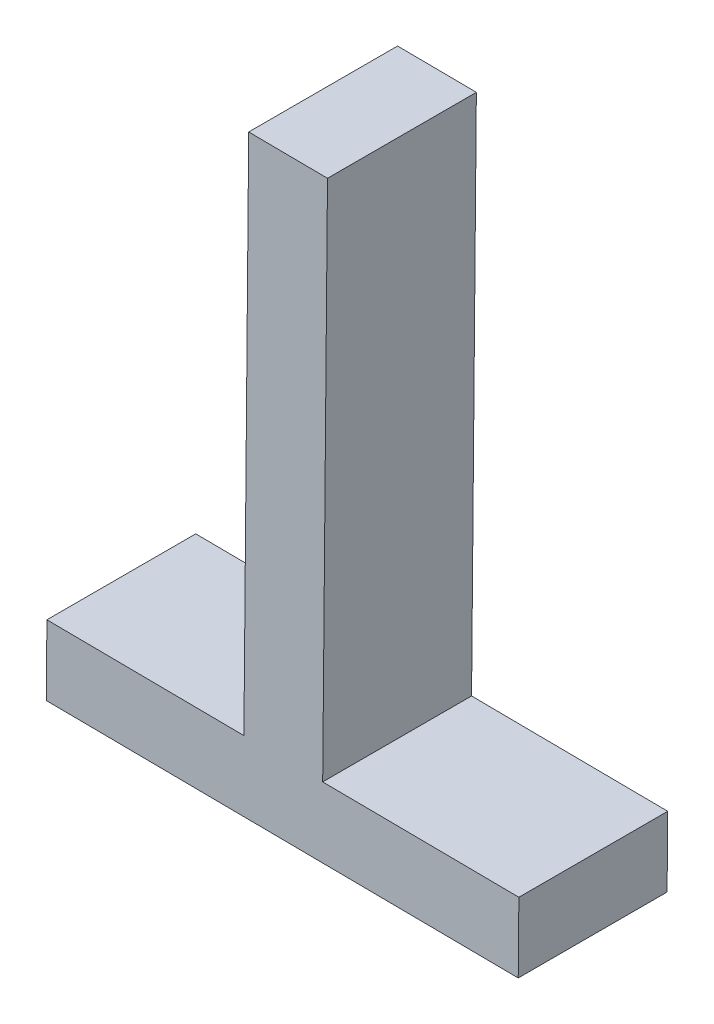
ISO-10303-21;
HEADER;
FILE_DESCRIPTION(('STEP AP214'),'2;1');
FILE_NAME('part.step','',(''),(''),'','','');
FILE_SCHEMA(('AUTOMOTIVE_DESIGN { 1 0 10303 214 1 1 1 1 }'));
ENDSEC;
DATA;
#1=APPLICATION_CONTEXT('core data for automotive mechanical design processes');
#2=APPLICATION_PROTOCOL_DEFINITION('international standard','automotive_design',2000,#1);
#3=PRODUCT_CONTEXT('',#1,'mechanical');
#4=PRODUCT('Part','Part','',(#3));
#5=PRODUCT_RELATED_PRODUCT_CATEGORY('part','',(#4));
#6=PRODUCT_DEFINITION_FORMATION('','',#4);
#7=PRODUCT_DEFINITION_CONTEXT('part definition',#1,'design');
#8=PRODUCT_DEFINITION('design','',#6,#7);
#9=PRODUCT_DEFINITION_SHAPE('','',#8);
#10=(LENGTH_UNIT() NAMED_UNIT(*) SI_UNIT(.MILLI.,.METRE.));
#11=(NAMED_UNIT(*) PLANE_ANGLE_UNIT() SI_UNIT($,.RADIAN.));
#12=(NAMED_UNIT(*) SI_UNIT($,.STERADIAN.) SOLID_ANGLE_UNIT());
#13=UNCERTAINTY_MEASURE_WITH_UNIT(LENGTH_MEASURE(1.E-05),#10,'distance_accuracy_value','');
#14=(GEOMETRIC_REPRESENTATION_CONTEXT(3) GLOBAL_UNCERTAINTY_ASSIGNED_CONTEXT((#13)) GLOBAL_UNIT_ASSIGNED_CONTEXT((#10,
#11,#12)) REPRESENTATION_CONTEXT('',''));
#15=CARTESIAN_POINT('',(0.,0.,0.));
#16=DIRECTION('',(0.,0.,1.));
#17=DIRECTION('',(1.,0.,0.));
#18=AXIS2_PLACEMENT_3D('',#15,#16,#17);
#19=CARTESIAN_POINT('',(2.9457992754223,7.53395539637065,0.));
#20=DIRECTION('',(0.00913854515184405,0.999958242624415,0.));
#21=DIRECTION('',(0.,0.,-1.));
#22=AXIS2_PLACEMENT_3D('',#19,#20,#21);
#23=PLANE('',#22);
#24=DIRECTION('',(0.999958242624415,-0.00913854515184405,0.));
#25=VECTOR('',#24,1.);
#26=CARTESIAN_POINT('',(2.61498093654606,7.53697872094363,0.));
#27=LINE('',#26,#25);
#28=CARTESIAN_POINT('',(2.61498093654606,7.53697872094363,0.));
#29=VERTEX_POINT('',#28);
#30=CARTESIAN_POINT('',(2.9457992754223,7.53395539637065,0.));
#31=VERTEX_POINT('',#30);
#32=EDGE_CURVE('E111',#29,#31,#27,.T.);
#33=ORIENTED_EDGE('',*,*,#32,.F.);
#34=DIRECTION('',(0.,0.,1.));
#35=VECTOR('',#34,1.);
#36=CARTESIAN_POINT('',(2.61498093654606,7.53697872094363,0.));
#37=LINE('',#36,#35);
#38=CARTESIAN_POINT('',(2.61498093654606,7.53697872094363,0.25));
#39=VERTEX_POINT('',#38);
#40=EDGE_CURVE('E90',#29,#39,#37,.T.);
#41=ORIENTED_EDGE('',*,*,#40,.T.);
#42=DIRECTION('',(-0.999958242624415,0.00913854515184405,0.));
#43=VECTOR('',#42,1.);
#44=CARTESIAN_POINT('',(2.61498093654606,7.53697872094363,0.25));
#45=LINE('',#44,#43);
#46=CARTESIAN_POINT('',(2.9457992754223,7.53395539637065,0.25));
#47=VERTEX_POINT('',#46);
#48=EDGE_CURVE('E148',#47,#39,#45,.T.);
#49=ORIENTED_EDGE('',*,*,#48,.F.);
#50=DIRECTION('',(0.,0.,1.));
#51=VECTOR('',#50,1.);
#52=CARTESIAN_POINT('',(2.9457992754223,7.53395539637065,0.));
#53=LINE('',#52,#51);
#54=EDGE_CURVE('E11',#31,#47,#53,.T.);
#55=ORIENTED_EDGE('',*,*,#54,.F.);
#56=EDGE_LOOP('',(#33,#41,#49,#55));
#57=FACE_BOUND('',#56,.T.);
#58=ADVANCED_FACE('F16',(#57),#23,.T.);
#59=CARTESIAN_POINT('',(2.95385939761582,8.41591040015481,0.));
#60=DIRECTION('',(-0.999958242624415,0.00913854515184294,0.));
#61=DIRECTION('',(0.,0.,1.));
#62=AXIS2_PLACEMENT_3D('',#59,#60,#61);
#63=PLANE('',#62);
#64=DIRECTION('',(0.00913854515184294,0.999958242624415,0.));
#65=VECTOR('',#64,1.);
#66=CARTESIAN_POINT('',(2.9457992754223,7.53395539637065,0.));
#67=LINE('',#66,#65);
#68=CARTESIAN_POINT('',(2.95385939761582,8.41591040015481,0.));
#69=VERTEX_POINT('',#68);
#70=EDGE_CURVE('E131',#31,#69,#67,.T.);
#71=ORIENTED_EDGE('',*,*,#70,.F.);
#72=ORIENTED_EDGE('',*,*,#54,.T.);
#73=DIRECTION('',(-0.00913854515184294,-0.999958242624415,0.));
#74=VECTOR('',#73,1.);
#75=CARTESIAN_POINT('',(2.9457992754223,7.53395539637065,0.25));
#76=LINE('',#75,#74);
#77=CARTESIAN_POINT('',(2.95385939761582,8.41591040015481,0.25));
#78=VERTEX_POINT('',#77);
#79=EDGE_CURVE('E152',#78,#47,#76,.T.);
#80=ORIENTED_EDGE('',*,*,#79,.F.);
#81=DIRECTION('',(0.,0.,1.));
#82=VECTOR('',#81,1.);
#83=CARTESIAN_POINT('',(2.95385939761582,8.41591040015481,0.));
#84=LINE('',#83,#82);
#85=EDGE_CURVE('E27',#69,#78,#84,.T.);
#86=ORIENTED_EDGE('',*,*,#85,.F.);
#87=EDGE_LOOP('',(#71,#72,#80,#86));
#88=FACE_BOUND('',#87,.T.);
#89=ADVANCED_FACE('F211',(#88),#63,.T.);
#90=CARTESIAN_POINT('',(3.08618680021874,8.41470106971283,0.));
#91=DIRECTION('',(0.00913854515184033,0.999958242624415,0.));
#92=DIRECTION('',(0.,0.,-1.));
#93=AXIS2_PLACEMENT_3D('',#90,#91,#92);
#94=PLANE('',#93);
#95=DIRECTION('',(0.999958242624415,-0.00913854515184033,0.));
#96=VECTOR('',#95,1.);
#97=CARTESIAN_POINT('',(2.95385939761582,8.41591040015481,0.));
#98=LINE('',#97,#96);
#99=CARTESIAN_POINT('',(3.08618680021874,8.41470106971283,0.));
#100=VERTEX_POINT('',#99);
#101=EDGE_CURVE('E123',#69,#100,#98,.T.);
#102=ORIENTED_EDGE('',*,*,#101,.F.);
#103=ORIENTED_EDGE('',*,*,#85,.T.);
#104=DIRECTION('',(-0.999958242624415,0.00913854515184033,0.));
#105=VECTOR('',#104,1.);
#106=CARTESIAN_POINT('',(2.95385939761582,8.41591040015481,0.25));
#107=LINE('',#106,#105);
#108=CARTESIAN_POINT('',(3.08618680021874,8.41470106971283,0.25));
#109=VERTEX_POINT('',#108);
#110=EDGE_CURVE('E170',#109,#78,#107,.T.);
#111=ORIENTED_EDGE('',*,*,#110,.F.);
#112=DIRECTION('',(0.,0.,1.));
#113=VECTOR('',#112,1.);
#114=CARTESIAN_POINT('',(3.08618680021874,8.41470106971283,0.));
#115=LINE('',#114,#113);
#116=EDGE_CURVE('E167',#100,#109,#115,.T.);
#117=ORIENTED_EDGE('',*,*,#116,.F.);
#118=EDGE_LOOP('',(#102,#103,#111,#117));
#119=FACE_BOUND('',#118,.T.);
#120=ADVANCED_FACE('F213',(#119),#94,.T.);
#121=CARTESIAN_POINT('',(2.61498093654606,7.53697872094363,0.));
#122=DIRECTION('',(-0.999958242624415,0.00913854515184164,0.));
#123=DIRECTION('',(0.,0.,1.));
#124=AXIS2_PLACEMENT_3D('',#121,#122,#123);
#125=PLANE('',#124);
#126=DIRECTION('',(0.00913854515184164,0.999958242624415,0.));
#127=VECTOR('',#126,1.);
#128=CARTESIAN_POINT('',(2.61390251345156,7.41897546720283,0.));
#129=LINE('',#128,#127);
#130=CARTESIAN_POINT('',(2.61390251345156,7.41897546720283,0.));
#131=VERTEX_POINT('',#130);
#132=EDGE_CURVE('E106',#131,#29,#129,.T.);
#133=ORIENTED_EDGE('',*,*,#132,.F.);
#134=DIRECTION('',(0.,0.,1.));
#135=VECTOR('',#134,1.);
#136=CARTESIAN_POINT('',(2.61390251345156,7.41897546720283,0.));
#137=LINE('',#136,#135);
#138=CARTESIAN_POINT('',(2.61390251345156,7.41897546720283,0.25));
#139=VERTEX_POINT('',#138);
#140=EDGE_CURVE('E95',#131,#139,#137,.T.);
#141=ORIENTED_EDGE('',*,*,#140,.T.);
#142=DIRECTION('',(-0.00913854515184164,-0.999958242624415,0.));
#143=VECTOR('',#142,1.);
#144=CARTESIAN_POINT('',(2.61390251345156,7.41897546720283,0.25));
#145=LINE('',#144,#143);
#146=EDGE_CURVE('E20',#39,#139,#145,.T.);
#147=ORIENTED_EDGE('',*,*,#146,.F.);
#148=ORIENTED_EDGE('',*,*,#40,.F.);
#149=EDGE_LOOP('',(#133,#141,#147,#148));
#150=FACE_BOUND('',#149,.T.);
#151=ADVANCED_FACE('F107',(#150),#125,.T.);
#152=CARTESIAN_POINT('',(3.40650243083946,7.41173195460036,0.));
#153=DIRECTION('',(0.999958242624415,-0.00913854515184164,0.));
#154=DIRECTION('',(0.,0.,-1.));
#155=AXIS2_PLACEMENT_3D('',#152,#153,#154);
#156=PLANE('',#155);
#157=DIRECTION('',(-0.00913854515184164,-0.999958242624415,0.));
#158=VECTOR('',#157,1.);
#159=CARTESIAN_POINT('',(3.40758085393395,7.52973520834115,0.));
#160=LINE('',#159,#158);
#161=CARTESIAN_POINT('',(3.40758085393395,7.52973520834115,0.));
#162=VERTEX_POINT('',#161);
#163=CARTESIAN_POINT('',(3.40650243083946,7.41173195460036,0.));
#164=VERTEX_POINT('',#163);
#165=EDGE_CURVE('E115',#162,#164,#160,.T.);
#166=ORIENTED_EDGE('',*,*,#165,.F.);
#167=DIRECTION('',(0.,0.,1.));
#168=VECTOR('',#167,1.);
#169=CARTESIAN_POINT('',(3.40758085393395,7.52973520834115,0.));
#170=LINE('',#169,#168);
#171=CARTESIAN_POINT('',(3.40758085393395,7.52973520834115,0.25));
#172=VERTEX_POINT('',#171);
#173=EDGE_CURVE('E137',#162,#172,#170,.T.);
#174=ORIENTED_EDGE('',*,*,#173,.T.);
#175=DIRECTION('',(0.00913854515184164,0.999958242624415,0.));
#176=VECTOR('',#175,1.);
#177=CARTESIAN_POINT('',(3.40758085393395,7.52973520834115,0.25));
#178=LINE('',#177,#176);
#179=CARTESIAN_POINT('',(3.40650243083946,7.41173195460036,0.25));
#180=VERTEX_POINT('',#179);
#181=EDGE_CURVE('E155',#180,#172,#178,.T.);
#182=ORIENTED_EDGE('',*,*,#181,.F.);
#183=DIRECTION('',(0.,0.,1.));
#184=VECTOR('',#183,1.);
#185=CARTESIAN_POINT('',(3.40650243083946,7.41173195460036,0.));
#186=LINE('',#185,#184);
#187=EDGE_CURVE('E41',#164,#180,#186,.T.);
#188=ORIENTED_EDGE('',*,*,#187,.F.);
#189=EDGE_LOOP('',(#166,#174,#182,#188));
#190=FACE_BOUND('',#189,.T.);
#191=ADVANCED_FACE('F218',(#190),#156,.T.);
#192=CARTESIAN_POINT('',(2.61390251345156,7.41897546720283,0.));
#193=DIRECTION('',(-0.00913854515184324,-0.999958242624415,0.));
#194=DIRECTION('',(-0.999958242624415,0.00913854515184324,0.));
#195=AXIS2_PLACEMENT_3D('',#192,#193,#194);
#196=PLANE('',#195);
#197=DIRECTION('',(-0.999958242624415,0.00913854515184324,0.));
#198=VECTOR('',#197,1.);
#199=CARTESIAN_POINT('',(3.40650243083946,7.41173195460036,0.));
#200=LINE('',#199,#198);
#201=EDGE_CURVE('E98',#164,#131,#200,.T.);
#202=ORIENTED_EDGE('',*,*,#201,.F.);
#203=ORIENTED_EDGE('',*,*,#187,.T.);
#204=DIRECTION('',(0.999958242624415,-0.00913854515184324,0.));
#205=VECTOR('',#204,1.);
#206=CARTESIAN_POINT('',(3.40650243083946,7.41173195460036,0.25));
#207=LINE('',#206,#205);
#208=EDGE_CURVE('E101',#139,#180,#207,.T.);
#209=ORIENTED_EDGE('',*,*,#208,.F.);
#210=ORIENTED_EDGE('',*,*,#140,.F.);
#211=EDGE_LOOP('',(#202,#203,#209,#210));
#212=FACE_BOUND('',#211,.T.);
#213=ADVANCED_FACE('F96',(#212),#196,.T.);
#214=CARTESIAN_POINT('',(0.0434994918093973,7.94596675152105,0.25));
#215=DIRECTION('',(0.,0.,1.));
#216=DIRECTION('',(1.,0.,0.));
#217=AXIS2_PLACEMENT_3D('',#214,#215,#216);
#218=PLANE('',#217);
#219=ORIENTED_EDGE('',*,*,#110,.T.);
#220=ORIENTED_EDGE('',*,*,#79,.T.);
#221=ORIENTED_EDGE('',*,*,#48,.T.);
#222=ORIENTED_EDGE('',*,*,#146,.T.);
#223=ORIENTED_EDGE('',*,*,#208,.T.);
#224=ORIENTED_EDGE('',*,*,#181,.T.);
#225=DIRECTION('',(-0.999958242624415,0.0091385451518436,0.));
#226=VECTOR('',#225,1.);
#227=CARTESIAN_POINT('',(3.07812667802522,7.53274606592867,0.25));
#228=LINE('',#227,#226);
#229=CARTESIAN_POINT('',(3.07812667802522,7.53274606592867,0.25));
#230=VERTEX_POINT('',#229);
#231=EDGE_CURVE('E134',#172,#230,#228,.T.);
#232=ORIENTED_EDGE('',*,*,#231,.T.);
#233=DIRECTION('',(0.00913854515184294,0.999958242624415,0.));
#234=VECTOR('',#233,1.);
#235=CARTESIAN_POINT('',(3.08618680021874,8.41470106971283,0.25));
#236=LINE('',#235,#234);
#237=EDGE_CURVE('E126',#230,#109,#236,.T.);
#238=ORIENTED_EDGE('',*,*,#237,.T.);
#239=EDGE_LOOP('',(#219,#220,#221,#222,#223,#224,#232,#238));
#240=FACE_BOUND('',#239,.T.);
#241=ADVANCED_FACE('F18',(#240),#218,.T.);
#242=CARTESIAN_POINT('',(0.0434994918093973,7.94596675152105,0.));
#243=DIRECTION('',(0.,0.,1.));
#244=DIRECTION('',(1.,0.,0.));
#245=AXIS2_PLACEMENT_3D('',#242,#243,#244);
#246=PLANE('',#245);
#247=ORIENTED_EDGE('',*,*,#101,.T.);
#248=DIRECTION('',(-0.00913854515184294,-0.999958242624415,0.));
#249=VECTOR('',#248,1.);
#250=CARTESIAN_POINT('',(3.08618680021874,8.41470106971283,0.));
#251=LINE('',#250,#249);
#252=CARTESIAN_POINT('',(3.07812667802522,7.53274606592867,0.));
#253=VERTEX_POINT('',#252);
#254=EDGE_CURVE('E164',#100,#253,#251,.T.);
#255=ORIENTED_EDGE('',*,*,#254,.T.);
#256=DIRECTION('',(0.999958242624415,-0.0091385451518436,0.));
#257=VECTOR('',#256,1.);
#258=CARTESIAN_POINT('',(3.07812667802522,7.53274606592867,0.));
#259=LINE('',#258,#257);
#260=EDGE_CURVE('E132',#253,#162,#259,.T.);
#261=ORIENTED_EDGE('',*,*,#260,.T.);
#262=ORIENTED_EDGE('',*,*,#165,.T.);
#263=ORIENTED_EDGE('',*,*,#201,.T.);
#264=ORIENTED_EDGE('',*,*,#132,.T.);
#265=ORIENTED_EDGE('',*,*,#32,.T.);
#266=ORIENTED_EDGE('',*,*,#70,.T.);
#267=EDGE_LOOP('',(#247,#255,#261,#262,#263,#264,#265,#266));
#268=FACE_BOUND('',#267,.T.);
#269=ADVANCED_FACE('F113',(#268),#246,.F.);
#270=CARTESIAN_POINT('',(3.40758085393395,7.52973520834115,0.));
#271=DIRECTION('',(0.0091385451518436,0.999958242624415,0.));
#272=DIRECTION('',(0.,0.,-1.));
#273=AXIS2_PLACEMENT_3D('',#270,#271,#272);
#274=PLANE('',#273);
#275=ORIENTED_EDGE('',*,*,#260,.F.);
#276=DIRECTION('',(0.,0.,1.));
#277=VECTOR('',#276,1.);
#278=CARTESIAN_POINT('',(3.07812667802522,7.53274606592867,0.));
#279=LINE('',#278,#277);
#280=EDGE_CURVE('E135',#253,#230,#279,.T.);
#281=ORIENTED_EDGE('',*,*,#280,.T.);
#282=ORIENTED_EDGE('',*,*,#231,.F.);
#283=ORIENTED_EDGE('',*,*,#173,.F.);
#284=EDGE_LOOP('',(#275,#281,#282,#283));
#285=FACE_BOUND('',#284,.T.);
#286=ADVANCED_FACE('F216',(#285),#274,.T.);
#287=CARTESIAN_POINT('',(3.07812667802522,7.53274606592867,0.));
#288=DIRECTION('',(0.999958242624415,-0.00913854515184294,0.));
#289=DIRECTION('',(0.,0.,-1.));
#290=AXIS2_PLACEMENT_3D('',#287,#288,#289);
#291=PLANE('',#290);
#292=ORIENTED_EDGE('',*,*,#254,.F.);
#293=ORIENTED_EDGE('',*,*,#116,.T.);
#294=ORIENTED_EDGE('',*,*,#237,.F.);
#295=ORIENTED_EDGE('',*,*,#280,.F.);
#296=EDGE_LOOP('',(#292,#293,#294,#295));
#297=FACE_BOUND('',#296,.T.);
#298=ADVANCED_FACE('F202',(#297),#291,.T.);
#299=CLOSED_SHELL('',(#58,#89,#120,#151,#191,#213,#241,#269,#286,#298));
#300=MANIFOLD_SOLID_BREP('B1',#299);
#301=ADVANCED_BREP_SHAPE_REPRESENTATION('',(#18,#300),#14);
#302=SHAPE_DEFINITION_REPRESENTATION(#9,#301);
ENDSEC;
END-ISO-10303-21;
